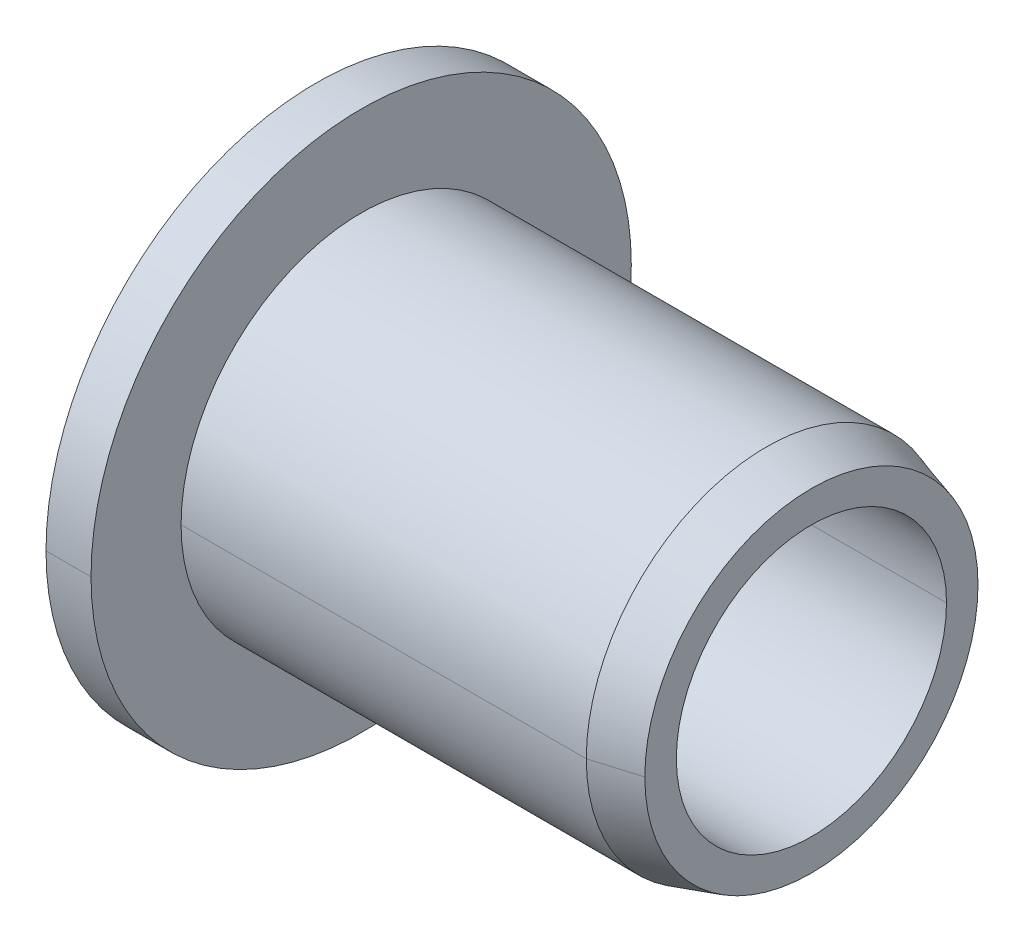
ISO-10303-21;
HEADER;
FILE_DESCRIPTION(('STEP AP214'),'2;1');
FILE_NAME('part.step','',(''),(''),'','','');
FILE_SCHEMA(('AUTOMOTIVE_DESIGN { 1 0 10303 214 1 1 1 1 }'));
ENDSEC;
DATA;
#1=APPLICATION_CONTEXT('core data for automotive mechanical design processes');
#2=APPLICATION_PROTOCOL_DEFINITION('international standard','automotive_design',2000,#1);
#3=PRODUCT_CONTEXT('',#1,'mechanical');
#4=PRODUCT('Part','Part','',(#3));
#5=PRODUCT_RELATED_PRODUCT_CATEGORY('part','',(#4));
#6=PRODUCT_DEFINITION_FORMATION('','',#4);
#7=PRODUCT_DEFINITION_CONTEXT('part definition',#1,'design');
#8=PRODUCT_DEFINITION('design','',#6,#7);
#9=PRODUCT_DEFINITION_SHAPE('','',#8);
#10=(LENGTH_UNIT() NAMED_UNIT(*) SI_UNIT(.MILLI.,.METRE.));
#11=(NAMED_UNIT(*) PLANE_ANGLE_UNIT() SI_UNIT($,.RADIAN.));
#12=(NAMED_UNIT(*) SI_UNIT($,.STERADIAN.) SOLID_ANGLE_UNIT());
#13=UNCERTAINTY_MEASURE_WITH_UNIT(LENGTH_MEASURE(1.E-05),#10,'distance_accuracy_value','');
#14=(GEOMETRIC_REPRESENTATION_CONTEXT(3) GLOBAL_UNCERTAINTY_ASSIGNED_CONTEXT((#13)) GLOBAL_UNIT_ASSIGNED_CONTEXT((#10,
#11,#12)) REPRESENTATION_CONTEXT('',''));
#15=CARTESIAN_POINT('',(0.,0.,0.));
#16=DIRECTION('',(0.,0.,1.));
#17=DIRECTION('',(1.,0.,0.));
#18=AXIS2_PLACEMENT_3D('',#15,#16,#17);
#19=CARTESIAN_POINT('',(0.,6.,0.));
#20=DIRECTION('',(-1.,0.,0.));
#21=DIRECTION('',(0.,0.,1.));
#22=AXIS2_PLACEMENT_3D('',#19,#20,#21);
#23=PLANE('',#22);
#24=CARTESIAN_POINT('',(0.,0.,0.));
#25=DIRECTION('',(1.,0.,0.));
#26=DIRECTION('',(0.,0.,-1.));
#27=AXIS2_PLACEMENT_3D('',#24,#25,#26);
#28=CIRCLE('',#27,3.3);
#29=CARTESIAN_POINT('',(0.,0.,-3.3));
#30=VERTEX_POINT('',#29);
#31=CARTESIAN_POINT('',(0.,0.,3.3));
#32=VERTEX_POINT('',#31);
#33=EDGE_CURVE('E11',#30,#32,#28,.T.);
#34=ORIENTED_EDGE('',*,*,#33,.T.);
#35=CARTESIAN_POINT('',(0.,0.,0.));
#36=DIRECTION('',(1.,0.,0.));
#37=DIRECTION('',(0.,0.,-1.));
#38=AXIS2_PLACEMENT_3D('',#35,#36,#37);
#39=CIRCLE('',#38,3.3);
#40=EDGE_CURVE('E25',#32,#30,#39,.T.);
#41=ORIENTED_EDGE('',*,*,#40,.T.);
#42=EDGE_LOOP('',(#34,#41));
#43=FACE_BOUND('',#42,.T.);
#44=CARTESIAN_POINT('',(0.,0.,0.));
#45=DIRECTION('',(1.,0.,0.));
#46=DIRECTION('',(0.,0.,-1.));
#47=AXIS2_PLACEMENT_3D('',#44,#45,#46);
#48=CIRCLE('',#47,6.);
#49=CARTESIAN_POINT('',(0.,0.,6.));
#50=VERTEX_POINT('',#49);
#51=CARTESIAN_POINT('',(0.,0.,-6.));
#52=VERTEX_POINT('',#51);
#53=EDGE_CURVE('E197',#50,#52,#48,.T.);
#54=ORIENTED_EDGE('',*,*,#53,.F.);
#55=CARTESIAN_POINT('',(0.,0.,0.));
#56=DIRECTION('',(1.,0.,0.));
#57=DIRECTION('',(0.,0.,-1.));
#58=AXIS2_PLACEMENT_3D('',#55,#56,#57);
#59=CIRCLE('',#58,6.);
#60=EDGE_CURVE('E192',#52,#50,#59,.T.);
#61=ORIENTED_EDGE('',*,*,#60,.F.);
#62=EDGE_LOOP('',(#54,#61));
#63=FACE_BOUND('',#62,.T.);
#64=ADVANCED_FACE('F17',(#43,#63),#23,.T.);
#65=CARTESIAN_POINT('',(11.,0.,0.));
#66=DIRECTION('',(1.,0.,0.));
#67=DIRECTION('',(0.,-1.,0.));
#68=AXIS2_PLACEMENT_3D('',#65,#66,#67);
#69=CYLINDRICAL_SURFACE('',#68,6.);
#70=DIRECTION('',(1.,0.,0.));
#71=VECTOR('',#70,1.);
#72=CARTESIAN_POINT('',(0.,0.,6.));
#73=LINE('',#72,#71);
#74=CARTESIAN_POINT('',(1.,0.,6.));
#75=VERTEX_POINT('',#74);
#76=EDGE_CURVE('E188',#50,#75,#73,.T.);
#77=ORIENTED_EDGE('',*,*,#76,.T.);
#78=CARTESIAN_POINT('',(1.,0.,0.));
#79=DIRECTION('',(1.,0.,0.));
#80=DIRECTION('',(0.,0.,-1.));
#81=AXIS2_PLACEMENT_3D('',#78,#79,#80);
#82=CIRCLE('',#81,6.);
#83=CARTESIAN_POINT('',(1.,0.,-6.));
#84=VERTEX_POINT('',#83);
#85=EDGE_CURVE('E183',#84,#75,#82,.T.);
#86=ORIENTED_EDGE('',*,*,#85,.F.);
#87=DIRECTION('',(1.,0.,0.));
#88=VECTOR('',#87,1.);
#89=CARTESIAN_POINT('',(0.,0.,-6.));
#90=LINE('',#89,#88);
#91=EDGE_CURVE('E178',#52,#84,#90,.T.);
#92=ORIENTED_EDGE('',*,*,#91,.F.);
#93=ORIENTED_EDGE('',*,*,#60,.T.);
#94=EDGE_LOOP('',(#77,#86,#92,#93));
#95=FACE_BOUND('',#94,.T.);
#96=ADVANCED_FACE('F213',(#95),#69,.T.);
#97=CARTESIAN_POINT('',(11.,0.,0.));
#98=DIRECTION('',(1.,0.,0.));
#99=DIRECTION('',(0.,1.,0.));
#100=AXIS2_PLACEMENT_3D('',#97,#98,#99);
#101=CYLINDRICAL_SURFACE('',#100,6.);
#102=ORIENTED_EDGE('',*,*,#76,.F.);
#103=ORIENTED_EDGE('',*,*,#53,.T.);
#104=ORIENTED_EDGE('',*,*,#91,.T.);
#105=CARTESIAN_POINT('',(1.,0.,0.));
#106=DIRECTION('',(1.,0.,0.));
#107=DIRECTION('',(0.,0.,-1.));
#108=AXIS2_PLACEMENT_3D('',#105,#106,#107);
#109=CIRCLE('',#108,6.);
#110=EDGE_CURVE('E173',#75,#84,#109,.T.);
#111=ORIENTED_EDGE('',*,*,#110,.F.);
#112=EDGE_LOOP('',(#102,#103,#104,#111));
#113=FACE_BOUND('',#112,.T.);
#114=ADVANCED_FACE('F208',(#113),#101,.T.);
#115=CARTESIAN_POINT('',(1.,4.,0.));
#116=DIRECTION('',(1.,0.,0.));
#117=DIRECTION('',(0.,0.,-1.));
#118=AXIS2_PLACEMENT_3D('',#115,#116,#117);
#119=PLANE('',#118);
#120=ORIENTED_EDGE('',*,*,#85,.T.);
#121=ORIENTED_EDGE('',*,*,#110,.T.);
#122=EDGE_LOOP('',(#120,#121));
#123=FACE_BOUND('',#122,.T.);
#124=CARTESIAN_POINT('',(1.,0.,0.));
#125=DIRECTION('',(1.,0.,0.));
#126=DIRECTION('',(0.,0.,-1.));
#127=AXIS2_PLACEMENT_3D('',#124,#125,#126);
#128=CIRCLE('',#127,4.);
#129=CARTESIAN_POINT('',(1.,0.,4.));
#130=VERTEX_POINT('',#129);
#131=CARTESIAN_POINT('',(1.,0.,-4.));
#132=VERTEX_POINT('',#131);
#133=EDGE_CURVE('E168',#130,#132,#128,.T.);
#134=ORIENTED_EDGE('',*,*,#133,.F.);
#135=CARTESIAN_POINT('',(1.,0.,0.));
#136=DIRECTION('',(1.,0.,0.));
#137=DIRECTION('',(0.,0.,-1.));
#138=AXIS2_PLACEMENT_3D('',#135,#136,#137);
#139=CIRCLE('',#138,4.);
#140=EDGE_CURVE('E163',#132,#130,#139,.T.);
#141=ORIENTED_EDGE('',*,*,#140,.F.);
#142=EDGE_LOOP('',(#134,#141));
#143=FACE_BOUND('',#142,.T.);
#144=ADVANCED_FACE('F215',(#123,#143),#119,.T.);
#145=CARTESIAN_POINT('',(11.,0.,0.));
#146=DIRECTION('',(1.,0.,0.));
#147=DIRECTION('',(0.,-1.,0.));
#148=AXIS2_PLACEMENT_3D('',#145,#146,#147);
#149=CYLINDRICAL_SURFACE('',#148,4.);
#150=DIRECTION('',(1.,0.,0.));
#151=VECTOR('',#150,1.);
#152=CARTESIAN_POINT('',(1.,0.,4.));
#153=LINE('',#152,#151);
#154=CARTESIAN_POINT('',(10.,0.,4.));
#155=VERTEX_POINT('',#154);
#156=EDGE_CURVE('E159',#130,#155,#153,.T.);
#157=ORIENTED_EDGE('',*,*,#156,.T.);
#158=CARTESIAN_POINT('',(10.,0.,0.));
#159=DIRECTION('',(1.,0.,0.));
#160=DIRECTION('',(0.,0.,-1.));
#161=AXIS2_PLACEMENT_3D('',#158,#159,#160);
#162=CIRCLE('',#161,4.);
#163=CARTESIAN_POINT('',(10.,0.,-4.));
#164=VERTEX_POINT('',#163);
#165=EDGE_CURVE('E154',#164,#155,#162,.T.);
#166=ORIENTED_EDGE('',*,*,#165,.F.);
#167=DIRECTION('',(1.,0.,0.));
#168=VECTOR('',#167,1.);
#169=CARTESIAN_POINT('',(1.,0.,-4.));
#170=LINE('',#169,#168);
#171=EDGE_CURVE('E149',#132,#164,#170,.T.);
#172=ORIENTED_EDGE('',*,*,#171,.F.);
#173=ORIENTED_EDGE('',*,*,#140,.T.);
#174=EDGE_LOOP('',(#157,#166,#172,#173));
#175=FACE_BOUND('',#174,.T.);
#176=ADVANCED_FACE('F218',(#175),#149,.T.);
#177=CARTESIAN_POINT('',(11.,0.,0.));
#178=DIRECTION('',(1.,0.,0.));
#179=DIRECTION('',(0.,1.,-5.8935951136395E-10));
#180=AXIS2_PLACEMENT_3D('',#177,#178,#179);
#181=CYLINDRICAL_SURFACE('',#180,4.);
#182=ORIENTED_EDGE('',*,*,#156,.F.);
#183=ORIENTED_EDGE('',*,*,#133,.T.);
#184=ORIENTED_EDGE('',*,*,#171,.T.);
#185=CARTESIAN_POINT('',(10.,0.,0.));
#186=DIRECTION('',(1.,0.,0.));
#187=DIRECTION('',(0.,0.,-1.));
#188=AXIS2_PLACEMENT_3D('',#185,#186,#187);
#189=CIRCLE('',#188,4.);
#190=EDGE_CURVE('E144',#155,#164,#189,.T.);
#191=ORIENTED_EDGE('',*,*,#190,.F.);
#192=EDGE_LOOP('',(#182,#183,#184,#191));
#193=FACE_BOUND('',#192,.T.);
#194=ADVANCED_FACE('F224',(#193),#181,.T.);
#195=CARTESIAN_POINT('',(11.,0.,0.));
#196=DIRECTION('',(-1.,0.,0.));
#197=DIRECTION('',(0.,1.,0.));
#198=AXIS2_PLACEMENT_3D('',#195,#196,#197);
#199=CONICAL_SURFACE('',#198,3.7,0.291456794477867);
#200=DIRECTION('',(-0.957826285221151,0.,-0.287347885566346));
#201=VECTOR('',#200,1.);
#202=CARTESIAN_POINT('',(11.,0.,-3.7));
#203=LINE('',#202,#201);
#204=CARTESIAN_POINT('',(11.,0.,-3.7));
#205=VERTEX_POINT('',#204);
#206=EDGE_CURVE('E139',#205,#164,#203,.T.);
#207=ORIENTED_EDGE('',*,*,#206,.F.);
#208=CARTESIAN_POINT('',(11.,0.,0.));
#209=DIRECTION('',(1.,0.,0.));
#210=DIRECTION('',(0.,0.,-1.));
#211=AXIS2_PLACEMENT_3D('',#208,#209,#210);
#212=CIRCLE('',#211,3.7);
#213=CARTESIAN_POINT('',(11.,0.,3.7));
#214=VERTEX_POINT('',#213);
#215=EDGE_CURVE('E134',#214,#205,#212,.T.);
#216=ORIENTED_EDGE('',*,*,#215,.F.);
#217=DIRECTION('',(-0.957826285221151,0.,0.287347885566346));
#218=VECTOR('',#217,1.);
#219=CARTESIAN_POINT('',(11.,0.,3.7));
#220=LINE('',#219,#218);
#221=EDGE_CURVE('E129',#214,#155,#220,.T.);
#222=ORIENTED_EDGE('',*,*,#221,.T.);
#223=ORIENTED_EDGE('',*,*,#190,.T.);
#224=EDGE_LOOP('',(#207,#216,#222,#223));
#225=FACE_BOUND('',#224,.T.);
#226=ADVANCED_FACE('F227',(#225),#199,.T.);
#227=CARTESIAN_POINT('',(11.,0.,0.));
#228=DIRECTION('',(-1.,0.,0.));
#229=DIRECTION('',(0.,-1.,0.));
#230=AXIS2_PLACEMENT_3D('',#227,#228,#229);
#231=CONICAL_SURFACE('',#230,3.7,0.291456794477867);
#232=ORIENTED_EDGE('',*,*,#206,.T.);
#233=ORIENTED_EDGE('',*,*,#165,.T.);
#234=ORIENTED_EDGE('',*,*,#221,.F.);
#235=CARTESIAN_POINT('',(11.,0.,0.));
#236=DIRECTION('',(1.,0.,0.));
#237=DIRECTION('',(0.,0.,-1.));
#238=AXIS2_PLACEMENT_3D('',#235,#236,#237);
#239=CIRCLE('',#238,3.7);
#240=EDGE_CURVE('E124',#205,#214,#239,.T.);
#241=ORIENTED_EDGE('',*,*,#240,.F.);
#242=EDGE_LOOP('',(#232,#233,#234,#241));
#243=FACE_BOUND('',#242,.T.);
#244=ADVANCED_FACE('F231',(#243),#231,.T.);
#245=CARTESIAN_POINT('',(11.,3.,0.));
#246=DIRECTION('',(1.,0.,0.));
#247=DIRECTION('',(0.,0.,-1.));
#248=AXIS2_PLACEMENT_3D('',#245,#246,#247);
#249=PLANE('',#248);
#250=ORIENTED_EDGE('',*,*,#240,.T.);
#251=ORIENTED_EDGE('',*,*,#215,.T.);
#252=EDGE_LOOP('',(#250,#251));
#253=FACE_BOUND('',#252,.T.);
#254=CARTESIAN_POINT('',(11.,0.,0.));
#255=DIRECTION('',(1.,0.,0.));
#256=DIRECTION('',(0.,0.,-1.));
#257=AXIS2_PLACEMENT_3D('',#254,#255,#256);
#258=CIRCLE('',#257,3.);
#259=CARTESIAN_POINT('',(11.,0.,3.));
#260=VERTEX_POINT('',#259);
#261=CARTESIAN_POINT('',(11.,0.,-3.));
#262=VERTEX_POINT('',#261);
#263=EDGE_CURVE('E95',#260,#262,#258,.T.);
#264=ORIENTED_EDGE('',*,*,#263,.F.);
#265=CARTESIAN_POINT('',(11.,0.,0.));
#266=DIRECTION('',(1.,0.,0.));
#267=DIRECTION('',(0.,0.,-1.));
#268=AXIS2_PLACEMENT_3D('',#265,#266,#267);
#269=CIRCLE('',#268,3.);
#270=EDGE_CURVE('E117',#262,#260,#269,.T.);
#271=ORIENTED_EDGE('',*,*,#270,.F.);
#272=EDGE_LOOP('',(#264,#271));
#273=FACE_BOUND('',#272,.T.);
#274=ADVANCED_FACE('F233',(#253,#273),#249,.T.);
#275=CARTESIAN_POINT('',(11.,0.,0.));
#276=DIRECTION('',(1.,0.,0.));
#277=DIRECTION('',(0.,-1.,0.));
#278=AXIS2_PLACEMENT_3D('',#275,#276,#277);
#279=CYLINDRICAL_SURFACE('',#278,3.);
#280=DIRECTION('',(1.,0.,0.));
#281=VECTOR('',#280,1.);
#282=CARTESIAN_POINT('',(0.300000000000001,0.,3.));
#283=LINE('',#282,#281);
#284=CARTESIAN_POINT('',(0.3,0.,3.));
#285=VERTEX_POINT('',#284);
#286=EDGE_CURVE('E85',#285,#260,#283,.T.);
#287=ORIENTED_EDGE('',*,*,#286,.F.);
#288=CARTESIAN_POINT('',(0.3,0.,0.));
#289=DIRECTION('',(1.,0.,0.));
#290=DIRECTION('',(0.,0.,-1.));
#291=AXIS2_PLACEMENT_3D('',#288,#289,#290);
#292=CIRCLE('',#291,3.);
#293=CARTESIAN_POINT('',(0.3,0.,-3.));
#294=VERTEX_POINT('',#293);
#295=EDGE_CURVE('E78',#294,#285,#292,.T.);
#296=ORIENTED_EDGE('',*,*,#295,.F.);
#297=DIRECTION('',(1.,0.,0.));
#298=VECTOR('',#297,1.);
#299=CARTESIAN_POINT('',(0.300000000000001,0.,-3.));
#300=LINE('',#299,#298);
#301=EDGE_CURVE('E82',#294,#262,#300,.T.);
#302=ORIENTED_EDGE('',*,*,#301,.T.);
#303=ORIENTED_EDGE('',*,*,#270,.T.);
#304=EDGE_LOOP('',(#287,#296,#302,#303));
#305=FACE_BOUND('',#304,.T.);
#306=ADVANCED_FACE('F80',(#305),#279,.F.);
#307=CARTESIAN_POINT('',(11.,0.,0.));
#308=DIRECTION('',(1.,0.,0.));
#309=DIRECTION('',(0.,1.,-1.61702901641324E-09));
#310=AXIS2_PLACEMENT_3D('',#307,#308,#309);
#311=CYLINDRICAL_SURFACE('',#310,3.);
#312=ORIENTED_EDGE('',*,*,#286,.T.);
#313=ORIENTED_EDGE('',*,*,#263,.T.);
#314=ORIENTED_EDGE('',*,*,#301,.F.);
#315=CARTESIAN_POINT('',(0.3,0.,0.));
#316=DIRECTION('',(1.,0.,0.));
#317=DIRECTION('',(0.,0.,-1.));
#318=AXIS2_PLACEMENT_3D('',#315,#316,#317);
#319=CIRCLE('',#318,3.);
#320=EDGE_CURVE('E93',#285,#294,#319,.T.);
#321=ORIENTED_EDGE('',*,*,#320,.F.);
#322=EDGE_LOOP('',(#312,#313,#314,#321));
#323=FACE_BOUND('',#322,.T.);
#324=ADVANCED_FACE('F92',(#323),#311,.F.);
#325=CARTESIAN_POINT('',(0.,0.,0.));
#326=DIRECTION('',(-1.,0.,0.));
#327=DIRECTION('',(0.,1.,0.));
#328=AXIS2_PLACEMENT_3D('',#325,#326,#327);
#329=CONICAL_SURFACE('',#328,3.3,0.785398163397448);
#330=DIRECTION('',(-0.707106781186548,0.,-0.707106781186548));
#331=VECTOR('',#330,1.);
#332=CARTESIAN_POINT('',(0.3,0.,-3.));
#333=LINE('',#332,#331);
#334=EDGE_CURVE('E99',#294,#30,#333,.T.);
#335=ORIENTED_EDGE('',*,*,#334,.T.);
#336=ORIENTED_EDGE('',*,*,#40,.F.);
#337=DIRECTION('',(-0.707106781186548,0.,0.707106781186548));
#338=VECTOR('',#337,1.);
#339=CARTESIAN_POINT('',(0.3,0.,3.));
#340=LINE('',#339,#338);
#341=EDGE_CURVE('E100',#285,#32,#340,.T.);
#342=ORIENTED_EDGE('',*,*,#341,.F.);
#343=ORIENTED_EDGE('',*,*,#320,.T.);
#344=EDGE_LOOP('',(#335,#336,#342,#343));
#345=FACE_BOUND('',#344,.T.);
#346=ADVANCED_FACE('F98',(#345),#329,.F.);
#347=CARTESIAN_POINT('',(0.,0.,0.));
#348=DIRECTION('',(-1.,0.,0.));
#349=DIRECTION('',(0.,-1.,0.));
#350=AXIS2_PLACEMENT_3D('',#347,#348,#349);
#351=CONICAL_SURFACE('',#350,3.3,0.785398163397448);
#352=ORIENTED_EDGE('',*,*,#334,.F.);
#353=ORIENTED_EDGE('',*,*,#295,.T.);
#354=ORIENTED_EDGE('',*,*,#341,.T.);
#355=ORIENTED_EDGE('',*,*,#33,.F.);
#356=EDGE_LOOP('',(#352,#353,#354,#355));
#357=FACE_BOUND('',#356,.T.);
#358=ADVANCED_FACE('F102',(#357),#351,.F.);
#359=CLOSED_SHELL('',(#64,#96,#114,#144,#176,#194,#226,#244,#274,#306,#324,#346,#358));
#360=MANIFOLD_SOLID_BREP('B1',#359);
#361=ADVANCED_BREP_SHAPE_REPRESENTATION('',(#18,#360),#14);
#362=SHAPE_DEFINITION_REPRESENTATION(#9,#361);
ENDSEC;
END-ISO-10303-21;
